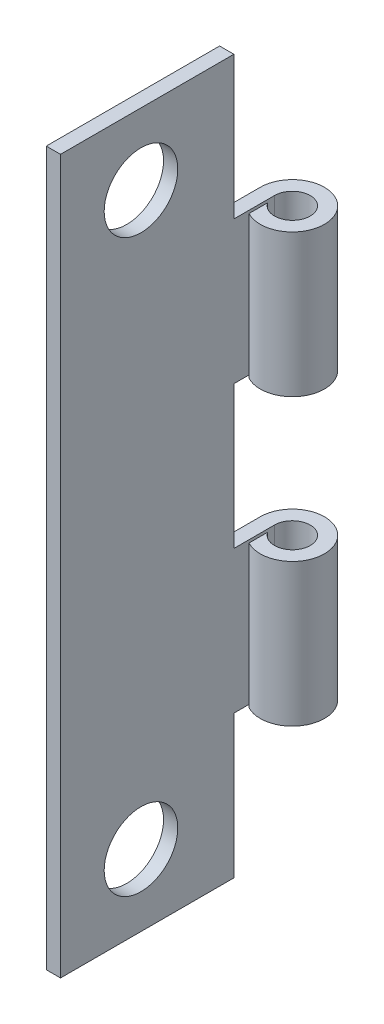
ISO-10303-21;
HEADER;
FILE_DESCRIPTION(('STEP AP214'),'2;1');
FILE_NAME('part.step','',(''),(''),'','','');
FILE_SCHEMA(('AUTOMOTIVE_DESIGN { 1 0 10303 214 1 1 1 1 }'));
ENDSEC;
DATA;
#1=APPLICATION_CONTEXT('core data for automotive mechanical design processes');
#2=APPLICATION_PROTOCOL_DEFINITION('international standard','automotive_design',2000,#1);
#3=PRODUCT_CONTEXT('',#1,'mechanical');
#4=PRODUCT('Part','Part','',(#3));
#5=PRODUCT_RELATED_PRODUCT_CATEGORY('part','',(#4));
#6=PRODUCT_DEFINITION_FORMATION('','',#4);
#7=PRODUCT_DEFINITION_CONTEXT('part definition',#1,'design');
#8=PRODUCT_DEFINITION('design','',#6,#7);
#9=PRODUCT_DEFINITION_SHAPE('','',#8);
#10=(LENGTH_UNIT() NAMED_UNIT(*) SI_UNIT(.MILLI.,.METRE.));
#11=(NAMED_UNIT(*) PLANE_ANGLE_UNIT() SI_UNIT($,.RADIAN.));
#12=(NAMED_UNIT(*) SI_UNIT($,.STERADIAN.) SOLID_ANGLE_UNIT());
#13=UNCERTAINTY_MEASURE_WITH_UNIT(LENGTH_MEASURE(1.E-05),#10,'distance_accuracy_value','');
#14=(GEOMETRIC_REPRESENTATION_CONTEXT(3) GLOBAL_UNCERTAINTY_ASSIGNED_CONTEXT((#13)) GLOBAL_UNIT_ASSIGNED_CONTEXT((#10,
#11,#12)) REPRESENTATION_CONTEXT('',''));
#15=CARTESIAN_POINT('',(0.,0.,0.));
#16=DIRECTION('',(0.,0.,1.));
#17=DIRECTION('',(1.,0.,0.));
#18=AXIS2_PLACEMENT_3D('',#15,#16,#17);
#19=CARTESIAN_POINT('',(1.42875,31.75,0.));
#20=DIRECTION('',(0.,-1.,0.));
#21=DIRECTION('',(0.,0.,-1.));
#22=AXIS2_PLACEMENT_3D('',#19,#20,#21);
#23=CYLINDRICAL_SURFACE('',#22,1.42875);
#24=DIRECTION('',(0.,-1.,0.));
#25=VECTOR('',#24,1.);
#26=CARTESIAN_POINT('',(0.762000000000001,31.75,1.26363404512541));
#27=LINE('',#26,#25);
#28=CARTESIAN_POINT('',(0.762000000000001,12.7,1.26363404512541));
#29=VERTEX_POINT('',#28);
#30=CARTESIAN_POINT('',(0.762000000000001,6.35,1.26363404512541));
#31=VERTEX_POINT('',#30);
#32=EDGE_CURVE('E202',#29,#31,#27,.T.);
#33=ORIENTED_EDGE('',*,*,#32,.T.);
#34=CARTESIAN_POINT('',(1.42875,6.35,0.));
#35=DIRECTION('',(0.,-1.,0.));
#36=DIRECTION('',(0.,0.,-1.));
#37=AXIS2_PLACEMENT_3D('',#34,#35,#36);
#38=CIRCLE('',#37,1.42875);
#39=CARTESIAN_POINT('',(0.,6.35,0.));
#40=VERTEX_POINT('',#39);
#41=EDGE_CURVE('E187',#40,#31,#38,.T.);
#42=ORIENTED_EDGE('',*,*,#41,.F.);
#43=DIRECTION('',(0.,-1.,0.));
#44=VECTOR('',#43,1.);
#45=CARTESIAN_POINT('',(0.,31.75,0.));
#46=LINE('',#45,#44);
#47=CARTESIAN_POINT('',(0.,12.7,0.));
#48=VERTEX_POINT('',#47);
#49=EDGE_CURVE('E224',#48,#40,#46,.T.);
#50=ORIENTED_EDGE('',*,*,#49,.F.);
#51=CARTESIAN_POINT('',(1.42875,12.7,0.));
#52=DIRECTION('',(0.,1.,0.));
#53=DIRECTION('',(0.,0.,1.));
#54=AXIS2_PLACEMENT_3D('',#51,#52,#53);
#55=CIRCLE('',#54,1.42875);
#56=EDGE_CURVE('E307',#29,#48,#55,.T.);
#57=ORIENTED_EDGE('',*,*,#56,.F.);
#58=EDGE_LOOP('',(#33,#42,#50,#57));
#59=FACE_BOUND('',#58,.T.);
#60=ADVANCED_FACE('F43',(#59),#23,.T.);
#61=CARTESIAN_POINT('',(1.42875,25.4,0.));
#62=DIRECTION('',(0.,1.,0.));
#63=DIRECTION('',(0.,0.,1.));
#64=AXIS2_PLACEMENT_3D('',#61,#62,#63);
#65=CIRCLE('',#64,1.42875);
#66=CARTESIAN_POINT('',(0.762000000000001,25.4,1.26363404512541));
#67=VERTEX_POINT('',#66);
#68=CARTESIAN_POINT('',(0.,25.4,0.));
#69=VERTEX_POINT('',#68);
#70=EDGE_CURVE('E316',#67,#69,#65,.T.);
#71=ORIENTED_EDGE('',*,*,#70,.F.);
#72=CARTESIAN_POINT('',(0.762000000000001,19.05,1.26363404512541));
#73=VERTEX_POINT('',#72);
#74=EDGE_CURVE('E206',#67,#73,#27,.T.);
#75=ORIENTED_EDGE('',*,*,#74,.T.);
#76=CARTESIAN_POINT('',(1.42875,19.05,0.));
#77=DIRECTION('',(0.,-1.,0.));
#78=DIRECTION('',(0.,0.,-1.));
#79=AXIS2_PLACEMENT_3D('',#76,#77,#78);
#80=CIRCLE('',#79,1.42875);
#81=CARTESIAN_POINT('',(0.,19.05,0.));
#82=VERTEX_POINT('',#81);
#83=EDGE_CURVE('E60',#82,#73,#80,.T.);
#84=ORIENTED_EDGE('',*,*,#83,.F.);
#85=EDGE_CURVE('E171',#69,#82,#46,.T.);
#86=ORIENTED_EDGE('',*,*,#85,.F.);
#87=EDGE_LOOP('',(#71,#75,#84,#86));
#88=FACE_BOUND('',#87,.T.);
#89=ADVANCED_FACE('F362',(#88),#23,.T.);
#90=CARTESIAN_POINT('',(0.,31.75,0.));
#91=DIRECTION('',(1.,0.,0.));
#92=DIRECTION('',(0.,0.,-1.));
#93=AXIS2_PLACEMENT_3D('',#90,#91,#92);
#94=PLANE('',#93);
#95=CARTESIAN_POINT('',(0.,28.575,5.94360000000001));
#96=DIRECTION('',(-1.,0.,0.));
#97=DIRECTION('',(0.,0.,-1.));
#98=AXIS2_PLACEMENT_3D('',#95,#96,#97);
#99=CIRCLE('',#98,1.6383);
#100=CARTESIAN_POINT('',(0.,28.575,4.30530000000001));
#101=VERTEX_POINT('',#100);
#102=EDGE_CURVE('E259',#101,#101,#99,.T.);
#103=ORIENTED_EDGE('',*,*,#102,.F.);
#104=EDGE_LOOP('',(#103));
#105=FACE_BOUND('',#104,.T.);
#106=CARTESIAN_POINT('',(0.,3.175,5.94360000000001));
#107=DIRECTION('',(1.,0.,0.));
#108=DIRECTION('',(0.,0.,-1.));
#109=AXIS2_PLACEMENT_3D('',#106,#107,#108);
#110=CIRCLE('',#109,1.6383);
#111=CARTESIAN_POINT('',(0.,3.175,4.30530000000001));
#112=VERTEX_POINT('',#111);
#113=EDGE_CURVE('E245',#112,#112,#110,.T.);
#114=ORIENTED_EDGE('',*,*,#113,.T.);
#115=EDGE_LOOP('',(#114));
#116=FACE_BOUND('',#115,.T.);
#117=DIRECTION('',(0.,-1.,0.));
#118=VECTOR('',#117,1.);
#119=CARTESIAN_POINT('',(0.,6.35,1.80975));
#120=LINE('',#119,#118);
#121=CARTESIAN_POINT('',(0.,6.35,1.80975));
#122=VERTEX_POINT('',#121);
#123=CARTESIAN_POINT('',(0.,0.,1.80975));
#124=VERTEX_POINT('',#123);
#125=EDGE_CURVE('E161',#122,#124,#120,.T.);
#126=ORIENTED_EDGE('',*,*,#125,.T.);
#127=DIRECTION('',(0.,0.,1.));
#128=VECTOR('',#127,1.);
#129=CARTESIAN_POINT('',(0.,0.,0.));
#130=LINE('',#129,#128);
#131=CARTESIAN_POINT('',(0.,0.,9.525));
#132=VERTEX_POINT('',#131);
#133=EDGE_CURVE('E176',#124,#132,#130,.T.);
#134=ORIENTED_EDGE('',*,*,#133,.T.);
#135=DIRECTION('',(0.,-1.,0.));
#136=VECTOR('',#135,1.);
#137=CARTESIAN_POINT('',(0.,31.75,9.525));
#138=LINE('',#137,#136);
#139=CARTESIAN_POINT('',(0.,31.75,9.525));
#140=VERTEX_POINT('',#139);
#141=EDGE_CURVE('E221',#140,#132,#138,.T.);
#142=ORIENTED_EDGE('',*,*,#141,.F.);
#143=DIRECTION('',(0.,0.,1.));
#144=VECTOR('',#143,1.);
#145=CARTESIAN_POINT('',(0.,31.75,0.));
#146=LINE('',#145,#144);
#147=CARTESIAN_POINT('',(0.,31.75,1.80975));
#148=VERTEX_POINT('',#147);
#149=EDGE_CURVE('E201',#148,#140,#146,.T.);
#150=ORIENTED_EDGE('',*,*,#149,.F.);
#151=DIRECTION('',(0.,-1.,0.));
#152=VECTOR('',#151,1.);
#153=CARTESIAN_POINT('',(0.,31.75,1.80975));
#154=LINE('',#153,#152);
#155=CARTESIAN_POINT('',(0.,25.4,1.80975));
#156=VERTEX_POINT('',#155);
#157=EDGE_CURVE('E68',#148,#156,#154,.T.);
#158=ORIENTED_EDGE('',*,*,#157,.T.);
#159=DIRECTION('',(0.,0.,-1.));
#160=VECTOR('',#159,1.);
#161=CARTESIAN_POINT('',(0.,25.4,1.80975));
#162=LINE('',#161,#160);
#163=EDGE_CURVE('E269',#156,#69,#162,.T.);
#164=ORIENTED_EDGE('',*,*,#163,.T.);
#165=ORIENTED_EDGE('',*,*,#85,.T.);
#166=DIRECTION('',(0.,0.,1.));
#167=VECTOR('',#166,1.);
#168=CARTESIAN_POINT('',(0.,19.05,1.80975));
#169=LINE('',#168,#167);
#170=CARTESIAN_POINT('',(0.,19.05,1.80975));
#171=VERTEX_POINT('',#170);
#172=EDGE_CURVE('E279',#82,#171,#169,.T.);
#173=ORIENTED_EDGE('',*,*,#172,.T.);
#174=DIRECTION('',(0.,-1.,0.));
#175=VECTOR('',#174,1.);
#176=CARTESIAN_POINT('',(0.,19.05,1.80975));
#177=LINE('',#176,#175);
#178=CARTESIAN_POINT('',(0.,12.7,1.80975));
#179=VERTEX_POINT('',#178);
#180=EDGE_CURVE('E244',#171,#179,#177,.T.);
#181=ORIENTED_EDGE('',*,*,#180,.T.);
#182=DIRECTION('',(0.,0.,-1.));
#183=VECTOR('',#182,1.);
#184=CARTESIAN_POINT('',(0.,12.7,1.80975));
#185=LINE('',#184,#183);
#186=EDGE_CURVE('E251',#179,#48,#185,.T.);
#187=ORIENTED_EDGE('',*,*,#186,.T.);
#188=ORIENTED_EDGE('',*,*,#49,.T.);
#189=DIRECTION('',(0.,0.,1.));
#190=VECTOR('',#189,1.);
#191=CARTESIAN_POINT('',(0.,6.35,1.80975));
#192=LINE('',#191,#190);
#193=EDGE_CURVE('E179',#40,#122,#192,.T.);
#194=ORIENTED_EDGE('',*,*,#193,.T.);
#195=EDGE_LOOP('',(#126,#134,#142,#150,#158,#164,#165,#173,#181,#187,#188,#194));
#196=FACE_BOUND('',#195,.T.);
#197=ADVANCED_FACE('F174',(#105,#116,#196),#94,.F.);
#198=CARTESIAN_POINT('',(0.635,31.75,9.525));
#199=DIRECTION('',(-1.,0.,0.));
#200=DIRECTION('',(0.,0.,1.));
#201=AXIS2_PLACEMENT_3D('',#198,#199,#200);
#202=PLANE('',#201);
#203=CARTESIAN_POINT('',(0.635,28.575,5.94360000000001));
#204=DIRECTION('',(-1.,0.,0.));
#205=DIRECTION('',(0.,0.,1.));
#206=AXIS2_PLACEMENT_3D('',#203,#204,#205);
#207=CIRCLE('',#206,1.6383);
#208=CARTESIAN_POINT('',(0.635,28.575,7.58190000000001));
#209=VERTEX_POINT('',#208);
#210=EDGE_CURVE('E46',#209,#209,#207,.T.);
#211=ORIENTED_EDGE('',*,*,#210,.T.);
#212=EDGE_LOOP('',(#211));
#213=FACE_BOUND('',#212,.T.);
#214=CARTESIAN_POINT('',(0.635,3.175,5.94360000000001));
#215=DIRECTION('',(-1.,0.,0.));
#216=DIRECTION('',(0.,0.,1.));
#217=AXIS2_PLACEMENT_3D('',#214,#215,#216);
#218=CIRCLE('',#217,1.6383);
#219=CARTESIAN_POINT('',(0.635,3.175,7.58190000000001));
#220=VERTEX_POINT('',#219);
#221=EDGE_CURVE('E241',#220,#220,#218,.F.);
#222=ORIENTED_EDGE('',*,*,#221,.F.);
#223=EDGE_LOOP('',(#222));
#224=FACE_BOUND('',#223,.T.);
#225=DIRECTION('',(0.,-1.,0.));
#226=VECTOR('',#225,1.);
#227=CARTESIAN_POINT('',(0.635,31.75,1.80975));
#228=LINE('',#227,#226);
#229=CARTESIAN_POINT('',(0.635,6.35,1.80975));
#230=VERTEX_POINT('',#229);
#231=CARTESIAN_POINT('',(0.635,0.,1.80975));
#232=VERTEX_POINT('',#231);
#233=EDGE_CURVE('E164',#230,#232,#228,.T.);
#234=ORIENTED_EDGE('',*,*,#233,.F.);
#235=DIRECTION('',(0.,0.,1.));
#236=VECTOR('',#235,1.);
#237=CARTESIAN_POINT('',(0.635,6.35,9.525));
#238=LINE('',#237,#236);
#239=CARTESIAN_POINT('',(0.635,6.35,0.));
#240=VERTEX_POINT('',#239);
#241=EDGE_CURVE('E193',#240,#230,#238,.T.);
#242=ORIENTED_EDGE('',*,*,#241,.F.);
#243=DIRECTION('',(0.,-1.,0.));
#244=VECTOR('',#243,1.);
#245=CARTESIAN_POINT('',(0.635,31.75,0.));
#246=LINE('',#245,#244);
#247=CARTESIAN_POINT('',(0.635,12.7,0.));
#248=VERTEX_POINT('',#247);
#249=EDGE_CURVE('E212',#248,#240,#246,.T.);
#250=ORIENTED_EDGE('',*,*,#249,.F.);
#251=DIRECTION('',(0.,0.,-1.));
#252=VECTOR('',#251,1.);
#253=CARTESIAN_POINT('',(0.635,12.7,9.525));
#254=LINE('',#253,#252);
#255=CARTESIAN_POINT('',(0.635,12.7,1.80975));
#256=VERTEX_POINT('',#255);
#257=EDGE_CURVE('E304',#256,#248,#254,.T.);
#258=ORIENTED_EDGE('',*,*,#257,.F.);
#259=DIRECTION('',(0.,-1.,0.));
#260=VECTOR('',#259,1.);
#261=CARTESIAN_POINT('',(0.635,31.75,1.80975));
#262=LINE('',#261,#260);
#263=CARTESIAN_POINT('',(0.635,19.05,1.80975));
#264=VERTEX_POINT('',#263);
#265=EDGE_CURVE('E11',#264,#256,#262,.T.);
#266=ORIENTED_EDGE('',*,*,#265,.F.);
#267=DIRECTION('',(0.,0.,1.));
#268=VECTOR('',#267,1.);
#269=CARTESIAN_POINT('',(0.635,19.05,9.525));
#270=LINE('',#269,#268);
#271=CARTESIAN_POINT('',(0.635,19.05,0.));
#272=VERTEX_POINT('',#271);
#273=EDGE_CURVE('E296',#272,#264,#270,.T.);
#274=ORIENTED_EDGE('',*,*,#273,.F.);
#275=CARTESIAN_POINT('',(0.635,25.4,0.));
#276=VERTEX_POINT('',#275);
#277=EDGE_CURVE('E216',#276,#272,#246,.T.);
#278=ORIENTED_EDGE('',*,*,#277,.F.);
#279=DIRECTION('',(0.,0.,-1.));
#280=VECTOR('',#279,1.);
#281=CARTESIAN_POINT('',(0.635,25.4,9.525));
#282=LINE('',#281,#280);
#283=CARTESIAN_POINT('',(0.635,25.4,1.80975));
#284=VERTEX_POINT('',#283);
#285=EDGE_CURVE('E313',#284,#276,#282,.T.);
#286=ORIENTED_EDGE('',*,*,#285,.F.);
#287=DIRECTION('',(0.,-1.,0.));
#288=VECTOR('',#287,1.);
#289=CARTESIAN_POINT('',(0.635,31.75,1.80975));
#290=LINE('',#289,#288);
#291=CARTESIAN_POINT('',(0.635,31.75,1.80975));
#292=VERTEX_POINT('',#291);
#293=EDGE_CURVE('E290',#292,#284,#290,.T.);
#294=ORIENTED_EDGE('',*,*,#293,.F.);
#295=DIRECTION('',(0.,0.,-1.));
#296=VECTOR('',#295,1.);
#297=CARTESIAN_POINT('',(0.635,31.75,9.525));
#298=LINE('',#297,#296);
#299=CARTESIAN_POINT('',(0.635,31.75,9.525));
#300=VERTEX_POINT('',#299);
#301=EDGE_CURVE('E196',#300,#292,#298,.T.);
#302=ORIENTED_EDGE('',*,*,#301,.F.);
#303=DIRECTION('',(0.,-1.,0.));
#304=VECTOR('',#303,1.);
#305=CARTESIAN_POINT('',(0.635,31.75,9.525));
#306=LINE('',#305,#304);
#307=CARTESIAN_POINT('',(0.635,0.,9.525));
#308=VERTEX_POINT('',#307);
#309=EDGE_CURVE('E217',#300,#308,#306,.T.);
#310=ORIENTED_EDGE('',*,*,#309,.T.);
#311=DIRECTION('',(0.,0.,-1.));
#312=VECTOR('',#311,1.);
#313=CARTESIAN_POINT('',(0.635,0.,9.525));
#314=LINE('',#313,#312);
#315=EDGE_CURVE('E191',#308,#232,#314,.T.);
#316=ORIENTED_EDGE('',*,*,#315,.T.);
#317=EDGE_LOOP('',(#234,#242,#250,#258,#266,#274,#278,#286,#294,#302,#310,#316));
#318=FACE_BOUND('',#317,.T.);
#319=ADVANCED_FACE('F337',(#213,#224,#318),#202,.F.);
#320=CARTESIAN_POINT('',(1.42875,31.75,0.));
#321=DIRECTION('',(0.,-1.,0.));
#322=DIRECTION('',(0.,0.,-1.));
#323=AXIS2_PLACEMENT_3D('',#320,#321,#322);
#324=CYLINDRICAL_SURFACE('',#323,0.79375);
#325=CARTESIAN_POINT('',(1.42875,6.35,0.));
#326=DIRECTION('',(0.,-1.,0.));
#327=DIRECTION('',(0.,0.,-1.));
#328=AXIS2_PLACEMENT_3D('',#325,#326,#327);
#329=CIRCLE('',#328,0.79375);
#330=CARTESIAN_POINT('',(0.762000000000001,6.35,0.430677953928456));
#331=VERTEX_POINT('',#330);
#332=EDGE_CURVE('E319',#331,#240,#329,.F.);
#333=ORIENTED_EDGE('',*,*,#332,.F.);
#334=DIRECTION('',(0.,-1.,0.));
#335=VECTOR('',#334,1.);
#336=CARTESIAN_POINT('',(0.762000000000001,31.75,0.430677953928456));
#337=LINE('',#336,#335);
#338=CARTESIAN_POINT('',(0.762000000000001,12.7,0.430677953928456));
#339=VERTEX_POINT('',#338);
#340=EDGE_CURVE('E207',#339,#331,#337,.T.);
#341=ORIENTED_EDGE('',*,*,#340,.F.);
#342=CARTESIAN_POINT('',(1.42875,12.7,0.));
#343=DIRECTION('',(0.,1.,0.));
#344=DIRECTION('',(0.,0.,1.));
#345=AXIS2_PLACEMENT_3D('',#342,#343,#344);
#346=CIRCLE('',#345,0.79375);
#347=EDGE_CURVE('E301',#248,#339,#346,.F.);
#348=ORIENTED_EDGE('',*,*,#347,.F.);
#349=ORIENTED_EDGE('',*,*,#249,.T.);
#350=EDGE_LOOP('',(#333,#341,#348,#349));
#351=FACE_BOUND('',#350,.T.);
#352=ADVANCED_FACE('F379',(#351),#324,.F.);
#353=CARTESIAN_POINT('',(1.42875,25.4,0.));
#354=DIRECTION('',(0.,1.,0.));
#355=DIRECTION('',(0.,0.,1.));
#356=AXIS2_PLACEMENT_3D('',#353,#354,#355);
#357=CIRCLE('',#356,0.79375);
#358=CARTESIAN_POINT('',(0.762000000000001,25.4,0.430677953928456));
#359=VERTEX_POINT('',#358);
#360=EDGE_CURVE('E310',#276,#359,#357,.F.);
#361=ORIENTED_EDGE('',*,*,#360,.F.);
#362=ORIENTED_EDGE('',*,*,#277,.T.);
#363=CARTESIAN_POINT('',(1.42875,19.05,0.));
#364=DIRECTION('',(0.,-1.,0.));
#365=DIRECTION('',(0.,0.,-1.));
#366=AXIS2_PLACEMENT_3D('',#363,#364,#365);
#367=CIRCLE('',#366,0.79375);
#368=CARTESIAN_POINT('',(0.762000000000001,19.05,0.430677953928456));
#369=VERTEX_POINT('',#368);
#370=EDGE_CURVE('E293',#369,#272,#367,.F.);
#371=ORIENTED_EDGE('',*,*,#370,.F.);
#372=EDGE_CURVE('E211',#359,#369,#337,.T.);
#373=ORIENTED_EDGE('',*,*,#372,.F.);
#374=EDGE_LOOP('',(#361,#362,#371,#373));
#375=FACE_BOUND('',#374,.T.);
#376=ADVANCED_FACE('F397',(#375),#324,.F.);
#377=CARTESIAN_POINT('',(0.762000000000001,31.75,0.430677953928456));
#378=DIRECTION('',(1.,0.,0.));
#379=DIRECTION('',(0.,0.,-1.));
#380=AXIS2_PLACEMENT_3D('',#377,#378,#379);
#381=PLANE('',#380);
#382=DIRECTION('',(0.,0.,-1.));
#383=VECTOR('',#382,1.);
#384=CARTESIAN_POINT('',(0.762000000000001,6.35,0.430677953928456));
#385=LINE('',#384,#383);
#386=EDGE_CURVE('E52',#31,#331,#385,.T.);
#387=ORIENTED_EDGE('',*,*,#386,.F.);
#388=ORIENTED_EDGE('',*,*,#32,.F.);
#389=DIRECTION('',(0.,0.,1.));
#390=VECTOR('',#389,1.);
#391=CARTESIAN_POINT('',(0.762000000000001,12.7,0.430677953928456));
#392=LINE('',#391,#390);
#393=EDGE_CURVE('E232',#339,#29,#392,.T.);
#394=ORIENTED_EDGE('',*,*,#393,.F.);
#395=ORIENTED_EDGE('',*,*,#340,.T.);
#396=EDGE_LOOP('',(#387,#388,#394,#395));
#397=FACE_BOUND('',#396,.T.);
#398=ADVANCED_FACE('F374',(#397),#381,.F.);
#399=DIRECTION('',(0.,0.,1.));
#400=VECTOR('',#399,1.);
#401=CARTESIAN_POINT('',(0.762000000000001,25.4,0.430677953928456));
#402=LINE('',#401,#400);
#403=EDGE_CURVE('E236',#359,#67,#402,.T.);
#404=ORIENTED_EDGE('',*,*,#403,.F.);
#405=ORIENTED_EDGE('',*,*,#372,.T.);
#406=DIRECTION('',(0.,0.,-1.));
#407=VECTOR('',#406,1.);
#408=CARTESIAN_POINT('',(0.762000000000001,19.05,0.430677953928456));
#409=LINE('',#408,#407);
#410=EDGE_CURVE('E229',#73,#369,#409,.T.);
#411=ORIENTED_EDGE('',*,*,#410,.F.);
#412=ORIENTED_EDGE('',*,*,#74,.F.);
#413=EDGE_LOOP('',(#404,#405,#411,#412));
#414=FACE_BOUND('',#413,.T.);
#415=ADVANCED_FACE('F407',(#414),#381,.F.);
#416=CARTESIAN_POINT('',(1.42875,31.75,0.));
#417=DIRECTION('',(0.,1.,0.));
#418=DIRECTION('',(0.,0.,1.));
#419=AXIS2_PLACEMENT_3D('',#416,#417,#418);
#420=PLANE('',#419);
#421=ORIENTED_EDGE('',*,*,#301,.T.);
#422=DIRECTION('',(-1.,0.,0.));
#423=VECTOR('',#422,1.);
#424=CARTESIAN_POINT('',(1.42875,31.75,1.80975));
#425=LINE('',#424,#423);
#426=EDGE_CURVE('E170',#292,#148,#425,.T.);
#427=ORIENTED_EDGE('',*,*,#426,.T.);
#428=ORIENTED_EDGE('',*,*,#149,.T.);
#429=DIRECTION('',(1.,0.,0.));
#430=VECTOR('',#429,1.);
#431=CARTESIAN_POINT('',(0.,31.75,9.525));
#432=LINE('',#431,#430);
#433=EDGE_CURVE('E325',#140,#300,#432,.T.);
#434=ORIENTED_EDGE('',*,*,#433,.T.);
#435=EDGE_LOOP('',(#421,#427,#428,#434));
#436=FACE_BOUND('',#435,.T.);
#437=ADVANCED_FACE('F333',(#436),#420,.T.);
#438=CARTESIAN_POINT('',(1.42875,0.,0.));
#439=DIRECTION('',(0.,1.,0.));
#440=DIRECTION('',(0.,0.,1.));
#441=AXIS2_PLACEMENT_3D('',#438,#439,#440);
#442=PLANE('',#441);
#443=DIRECTION('',(-1.,0.,0.));
#444=VECTOR('',#443,1.);
#445=CARTESIAN_POINT('',(1.42875,0.,1.80975));
#446=LINE('',#445,#444);
#447=EDGE_CURVE('E157',#232,#124,#446,.T.);
#448=ORIENTED_EDGE('',*,*,#447,.F.);
#449=ORIENTED_EDGE('',*,*,#315,.F.);
#450=DIRECTION('',(1.,0.,0.));
#451=VECTOR('',#450,1.);
#452=CARTESIAN_POINT('',(0.,0.,9.525));
#453=LINE('',#452,#451);
#454=EDGE_CURVE('E185',#132,#308,#453,.T.);
#455=ORIENTED_EDGE('',*,*,#454,.F.);
#456=ORIENTED_EDGE('',*,*,#133,.F.);
#457=EDGE_LOOP('',(#448,#449,#455,#456));
#458=FACE_BOUND('',#457,.T.);
#459=ADVANCED_FACE('F184',(#458),#442,.F.);
#460=CARTESIAN_POINT('',(0.,31.75,9.525));
#461=DIRECTION('',(0.,0.,-1.));
#462=DIRECTION('',(-1.,0.,0.));
#463=AXIS2_PLACEMENT_3D('',#460,#461,#462);
#464=PLANE('',#463);
#465=ORIENTED_EDGE('',*,*,#454,.T.);
#466=ORIENTED_EDGE('',*,*,#309,.F.);
#467=ORIENTED_EDGE('',*,*,#433,.F.);
#468=ORIENTED_EDGE('',*,*,#141,.T.);
#469=EDGE_LOOP('',(#465,#466,#467,#468));
#470=FACE_BOUND('',#469,.T.);
#471=ADVANCED_FACE('F349',(#470),#464,.F.);
#472=CARTESIAN_POINT('',(2.8575,6.35,1.80975));
#473=DIRECTION('',(0.,-1.,0.));
#474=DIRECTION('',(0.,0.,-1.));
#475=AXIS2_PLACEMENT_3D('',#472,#473,#474);
#476=PLANE('',#475);
#477=ORIENTED_EDGE('',*,*,#41,.T.);
#478=ORIENTED_EDGE('',*,*,#386,.T.);
#479=ORIENTED_EDGE('',*,*,#332,.T.);
#480=ORIENTED_EDGE('',*,*,#241,.T.);
#481=DIRECTION('',(-1.,0.,0.));
#482=VECTOR('',#481,1.);
#483=CARTESIAN_POINT('',(2.8575,6.35,1.80975));
#484=LINE('',#483,#482);
#485=EDGE_CURVE('E264',#230,#122,#484,.T.);
#486=ORIENTED_EDGE('',*,*,#485,.T.);
#487=ORIENTED_EDGE('',*,*,#193,.F.);
#488=EDGE_LOOP('',(#477,#478,#479,#480,#486,#487));
#489=FACE_BOUND('',#488,.T.);
#490=ADVANCED_FACE('F351',(#489),#476,.T.);
#491=CARTESIAN_POINT('',(2.8575,6.35,1.80975));
#492=DIRECTION('',(0.,0.,-1.));
#493=DIRECTION('',(0.,1.,0.));
#494=AXIS2_PLACEMENT_3D('',#491,#492,#493);
#495=PLANE('',#494);
#496=ORIENTED_EDGE('',*,*,#233,.T.);
#497=ORIENTED_EDGE('',*,*,#447,.T.);
#498=ORIENTED_EDGE('',*,*,#125,.F.);
#499=ORIENTED_EDGE('',*,*,#485,.F.);
#500=EDGE_LOOP('',(#496,#497,#498,#499));
#501=FACE_BOUND('',#500,.T.);
#502=ADVANCED_FACE('F159',(#501),#495,.T.);
#503=CARTESIAN_POINT('',(2.8575,25.4,1.80975));
#504=DIRECTION('',(0.,1.,0.));
#505=DIRECTION('',(0.,0.,1.));
#506=AXIS2_PLACEMENT_3D('',#503,#504,#505);
#507=PLANE('',#506);
#508=ORIENTED_EDGE('',*,*,#70,.T.);
#509=ORIENTED_EDGE('',*,*,#163,.F.);
#510=DIRECTION('',(-1.,0.,0.));
#511=VECTOR('',#510,1.);
#512=CARTESIAN_POINT('',(2.8575,25.4,1.80975));
#513=LINE('',#512,#511);
#514=EDGE_CURVE('E181',#284,#156,#513,.T.);
#515=ORIENTED_EDGE('',*,*,#514,.F.);
#516=ORIENTED_EDGE('',*,*,#285,.T.);
#517=ORIENTED_EDGE('',*,*,#360,.T.);
#518=ORIENTED_EDGE('',*,*,#403,.T.);
#519=EDGE_LOOP('',(#508,#509,#515,#516,#517,#518));
#520=FACE_BOUND('',#519,.T.);
#521=ADVANCED_FACE('F344',(#520),#507,.T.);
#522=CARTESIAN_POINT('',(2.8575,31.75,1.80975));
#523=DIRECTION('',(0.,0.,-1.));
#524=DIRECTION('',(0.,1.,0.));
#525=AXIS2_PLACEMENT_3D('',#522,#523,#524);
#526=PLANE('',#525);
#527=ORIENTED_EDGE('',*,*,#293,.T.);
#528=ORIENTED_EDGE('',*,*,#514,.T.);
#529=ORIENTED_EDGE('',*,*,#157,.F.);
#530=ORIENTED_EDGE('',*,*,#426,.F.);
#531=EDGE_LOOP('',(#527,#528,#529,#530));
#532=FACE_BOUND('',#531,.T.);
#533=ADVANCED_FACE('F341',(#532),#526,.T.);
#534=CARTESIAN_POINT('',(2.8575,19.05,1.80975));
#535=DIRECTION('',(0.,0.,-1.));
#536=DIRECTION('',(0.,1.,0.));
#537=AXIS2_PLACEMENT_3D('',#534,#535,#536);
#538=PLANE('',#537);
#539=ORIENTED_EDGE('',*,*,#265,.T.);
#540=DIRECTION('',(-1.,0.,0.));
#541=VECTOR('',#540,1.);
#542=CARTESIAN_POINT('',(2.8575,12.7,1.80975));
#543=LINE('',#542,#541);
#544=EDGE_CURVE('E270',#256,#179,#543,.T.);
#545=ORIENTED_EDGE('',*,*,#544,.T.);
#546=ORIENTED_EDGE('',*,*,#180,.F.);
#547=DIRECTION('',(-1.,0.,0.));
#548=VECTOR('',#547,1.);
#549=CARTESIAN_POINT('',(2.8575,19.05,1.80975));
#550=LINE('',#549,#548);
#551=EDGE_CURVE('E283',#264,#171,#550,.T.);
#552=ORIENTED_EDGE('',*,*,#551,.F.);
#553=EDGE_LOOP('',(#539,#545,#546,#552));
#554=FACE_BOUND('',#553,.T.);
#555=ADVANCED_FACE('F391',(#554),#538,.T.);
#556=CARTESIAN_POINT('',(2.8575,12.7,1.80975));
#557=DIRECTION('',(0.,1.,0.));
#558=DIRECTION('',(0.,0.,1.));
#559=AXIS2_PLACEMENT_3D('',#556,#557,#558);
#560=PLANE('',#559);
#561=ORIENTED_EDGE('',*,*,#56,.T.);
#562=ORIENTED_EDGE('',*,*,#186,.F.);
#563=ORIENTED_EDGE('',*,*,#544,.F.);
#564=ORIENTED_EDGE('',*,*,#257,.T.);
#565=ORIENTED_EDGE('',*,*,#347,.T.);
#566=ORIENTED_EDGE('',*,*,#393,.T.);
#567=EDGE_LOOP('',(#561,#562,#563,#564,#565,#566));
#568=FACE_BOUND('',#567,.T.);
#569=ADVANCED_FACE('F387',(#568),#560,.T.);
#570=CARTESIAN_POINT('',(2.8575,19.05,1.80975));
#571=DIRECTION('',(0.,-1.,0.));
#572=DIRECTION('',(0.,0.,-1.));
#573=AXIS2_PLACEMENT_3D('',#570,#571,#572);
#574=PLANE('',#573);
#575=ORIENTED_EDGE('',*,*,#83,.T.);
#576=ORIENTED_EDGE('',*,*,#410,.T.);
#577=ORIENTED_EDGE('',*,*,#370,.T.);
#578=ORIENTED_EDGE('',*,*,#273,.T.);
#579=ORIENTED_EDGE('',*,*,#551,.T.);
#580=ORIENTED_EDGE('',*,*,#172,.F.);
#581=EDGE_LOOP('',(#575,#576,#577,#578,#579,#580));
#582=FACE_BOUND('',#581,.T.);
#583=ADVANCED_FACE('F393',(#582),#574,.T.);
#584=CARTESIAN_POINT('',(2.8575,3.175,5.94360000000001));
#585=DIRECTION('',(-1.,0.,0.));
#586=DIRECTION('',(0.,0.,1.));
#587=AXIS2_PLACEMENT_3D('',#584,#585,#586);
#588=CYLINDRICAL_SURFACE('',#587,1.6383);
#589=ORIENTED_EDGE('',*,*,#113,.F.);
#590=EDGE_LOOP('',(#589));
#591=FACE_BOUND('',#590,.T.);
#592=ORIENTED_EDGE('',*,*,#221,.T.);
#593=EDGE_LOOP('',(#592));
#594=FACE_BOUND('',#593,.T.);
#595=ADVANCED_FACE('F428',(#591,#594),#588,.F.);
#596=CARTESIAN_POINT('',(2.8575,28.575,5.94360000000001));
#597=DIRECTION('',(-1.,0.,0.));
#598=DIRECTION('',(0.,0.,1.));
#599=AXIS2_PLACEMENT_3D('',#596,#597,#598);
#600=CYLINDRICAL_SURFACE('',#599,1.6383);
#601=ORIENTED_EDGE('',*,*,#102,.T.);
#602=EDGE_LOOP('',(#601));
#603=FACE_BOUND('',#602,.T.);
#604=ORIENTED_EDGE('',*,*,#210,.F.);
#605=EDGE_LOOP('',(#604));
#606=FACE_BOUND('',#605,.T.);
#607=ADVANCED_FACE('F426',(#603,#606),#600,.F.);
#608=CLOSED_SHELL('',(#60,#89,#197,#319,#352,#376,#398,#415,#437,#459,#471,#490,#502,#521,#533,
#555,#569,#583,#595,#607));
#609=MANIFOLD_SOLID_BREP('B2',#608);
#610=ADVANCED_BREP_SHAPE_REPRESENTATION('',(#18,#609),#14);
#611=SHAPE_DEFINITION_REPRESENTATION(#9,#610);
ENDSEC;
END-ISO-10303-21;
